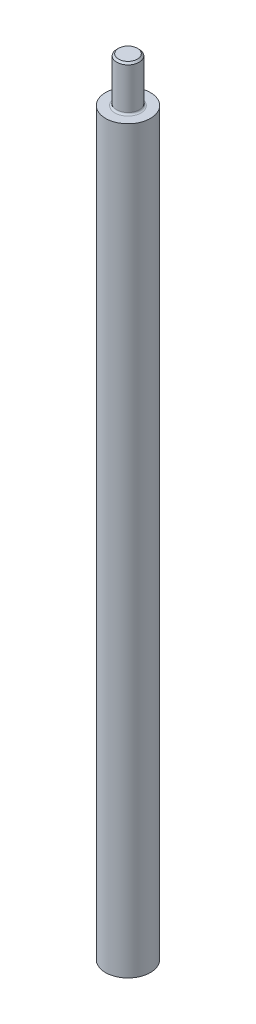
ISO-10303-21;
HEADER;
FILE_DESCRIPTION(('STEP AP214'),'2;1');
FILE_NAME('part.step','',(''),(''),'','','');
FILE_SCHEMA(('AUTOMOTIVE_DESIGN { 1 0 10303 214 1 1 1 1 }'));
ENDSEC;
DATA;
#1=APPLICATION_CONTEXT('core data for automotive mechanical design processes');
#2=APPLICATION_PROTOCOL_DEFINITION('international standard','automotive_design',2000,#1);
#3=PRODUCT_CONTEXT('',#1,'mechanical');
#4=PRODUCT('Part','Part','',(#3));
#5=PRODUCT_RELATED_PRODUCT_CATEGORY('part','',(#4));
#6=PRODUCT_DEFINITION_FORMATION('','',#4);
#7=PRODUCT_DEFINITION_CONTEXT('part definition',#1,'design');
#8=PRODUCT_DEFINITION('design','',#6,#7);
#9=PRODUCT_DEFINITION_SHAPE('','',#8);
#10=(LENGTH_UNIT() NAMED_UNIT(*) SI_UNIT(.MILLI.,.METRE.));
#11=(NAMED_UNIT(*) PLANE_ANGLE_UNIT() SI_UNIT($,.RADIAN.));
#12=(NAMED_UNIT(*) SI_UNIT($,.STERADIAN.) SOLID_ANGLE_UNIT());
#13=UNCERTAINTY_MEASURE_WITH_UNIT(LENGTH_MEASURE(1.E-05),#10,'distance_accuracy_value','');
#14=(GEOMETRIC_REPRESENTATION_CONTEXT(3) GLOBAL_UNCERTAINTY_ASSIGNED_CONTEXT((#13)) GLOBAL_UNIT_ASSIGNED_CONTEXT((#10,
#11,#12)) REPRESENTATION_CONTEXT('',''));
#15=CARTESIAN_POINT('',(0.,0.,0.));
#16=DIRECTION('',(0.,0.,1.));
#17=DIRECTION('',(1.,0.,0.));
#18=AXIS2_PLACEMENT_3D('',#15,#16,#17);
#19=CARTESIAN_POINT('',(0.,104.775,0.));
#20=DIRECTION('',(0.,-1.,0.));
#21=DIRECTION('',(0.,0.,-1.));
#22=AXIS2_PLACEMENT_3D('',#19,#20,#21);
#23=CYLINDRICAL_SURFACE('',#22,6.35);
#24=CARTESIAN_POINT('',(0.,104.775,0.));
#25=DIRECTION('',(0.,1.,0.));
#26=DIRECTION('',(0.,0.,1.));
#27=AXIS2_PLACEMENT_3D('',#24,#25,#26);
#28=CIRCLE('',#27,6.35);
#29=CARTESIAN_POINT('',(0.,104.775,6.35));
#30=VERTEX_POINT('',#29);
#31=EDGE_CURVE('E51',#30,#30,#28,.T.);
#32=ORIENTED_EDGE('',*,*,#31,.F.);
#33=EDGE_LOOP('',(#32));
#34=FACE_BOUND('',#33,.T.);
#35=CARTESIAN_POINT('',(0.,-104.775,0.));
#36=DIRECTION('',(0.,1.,0.));
#37=DIRECTION('',(0.,0.,1.));
#38=AXIS2_PLACEMENT_3D('',#35,#36,#37);
#39=CIRCLE('',#38,6.35);
#40=CARTESIAN_POINT('',(0.,-104.775,6.35));
#41=VERTEX_POINT('',#40);
#42=EDGE_CURVE('E52',#41,#41,#39,.T.);
#43=ORIENTED_EDGE('',*,*,#42,.T.);
#44=EDGE_LOOP('',(#43));
#45=FACE_BOUND('',#44,.T.);
#46=ADVANCED_FACE('F31',(#34,#45),#23,.T.);
#47=CARTESIAN_POINT('',(0.,104.775,0.));
#48=DIRECTION('',(0.,1.,0.));
#49=DIRECTION('',(0.,0.,1.));
#50=AXIS2_PLACEMENT_3D('',#47,#48,#49);
#51=PLANE('',#50);
#52=CARTESIAN_POINT('',(0.,104.775,0.));
#53=DIRECTION('',(0.,1.,0.));
#54=DIRECTION('',(0.,0.,1.));
#55=AXIS2_PLACEMENT_3D('',#52,#53,#54);
#56=CIRCLE('',#55,3.683);
#57=CARTESIAN_POINT('',(0.,104.775,3.683));
#58=VERTEX_POINT('',#57);
#59=EDGE_CURVE('E42',#58,#58,#56,.F.);
#60=ORIENTED_EDGE('',*,*,#59,.T.);
#61=EDGE_LOOP('',(#60));
#62=FACE_BOUND('',#61,.T.);
#63=ORIENTED_EDGE('',*,*,#31,.T.);
#64=EDGE_LOOP('',(#63));
#65=FACE_BOUND('',#64,.T.);
#66=ADVANCED_FACE('F58',(#62,#65),#51,.T.);
#67=CARTESIAN_POINT('',(0.,-104.775,0.));
#68=DIRECTION('',(0.,1.,0.));
#69=DIRECTION('',(0.,0.,1.));
#70=AXIS2_PLACEMENT_3D('',#67,#68,#69);
#71=PLANE('',#70);
#72=ORIENTED_EDGE('',*,*,#42,.F.);
#73=EDGE_LOOP('',(#72));
#74=FACE_BOUND('',#73,.T.);
#75=ADVANCED_FACE('F65',(#74),#71,.F.);
#76=CARTESIAN_POINT('',(0.,117.475,0.));
#77=DIRECTION('',(0.,-1.,0.));
#78=DIRECTION('',(0.,0.,-1.));
#79=AXIS2_PLACEMENT_3D('',#76,#77,#78);
#80=CYLINDRICAL_SURFACE('',#79,3.175);
#81=CARTESIAN_POINT('',(0.,116.967,0.));
#82=DIRECTION('',(0.,1.,0.));
#83=DIRECTION('',(0.,0.,1.));
#84=AXIS2_PLACEMENT_3D('',#81,#82,#83);
#85=CIRCLE('',#84,3.175);
#86=CARTESIAN_POINT('',(0.,116.967,3.175));
#87=VERTEX_POINT('',#86);
#88=EDGE_CURVE('E10',#87,#87,#85,.F.);
#89=ORIENTED_EDGE('',*,*,#88,.T.);
#90=EDGE_LOOP('',(#89));
#91=FACE_BOUND('',#90,.T.);
#92=CARTESIAN_POINT('',(0.,105.283,0.));
#93=DIRECTION('',(0.,1.,0.));
#94=DIRECTION('',(0.,0.,1.));
#95=AXIS2_PLACEMENT_3D('',#92,#93,#94);
#96=CIRCLE('',#95,3.175);
#97=CARTESIAN_POINT('',(0.,105.283,3.175));
#98=VERTEX_POINT('',#97);
#99=EDGE_CURVE('E46',#98,#98,#96,.T.);
#100=ORIENTED_EDGE('',*,*,#99,.T.);
#101=EDGE_LOOP('',(#100));
#102=FACE_BOUND('',#101,.T.);
#103=ADVANCED_FACE('F67',(#91,#102),#80,.T.);
#104=CARTESIAN_POINT('',(0.,117.475,0.));
#105=DIRECTION('',(0.,1.,0.));
#106=DIRECTION('',(0.,0.,1.));
#107=AXIS2_PLACEMENT_3D('',#104,#105,#106);
#108=PLANE('',#107);
#109=CARTESIAN_POINT('',(0.,117.475,0.));
#110=DIRECTION('',(0.,1.,0.));
#111=DIRECTION('',(0.,0.,1.));
#112=AXIS2_PLACEMENT_3D('',#109,#110,#111);
#113=CIRCLE('',#112,2.667);
#114=CARTESIAN_POINT('',(0.,117.475,2.667));
#115=VERTEX_POINT('',#114);
#116=EDGE_CURVE('E38',#115,#115,#113,.T.);
#117=ORIENTED_EDGE('',*,*,#116,.T.);
#118=EDGE_LOOP('',(#117));
#119=FACE_BOUND('',#118,.T.);
#120=ADVANCED_FACE('F74',(#119),#108,.T.);
#121=CARTESIAN_POINT('',(0.,105.283,0.));
#122=DIRECTION('',(0.,1.,0.));
#123=DIRECTION('',(0.,0.,1.));
#124=AXIS2_PLACEMENT_3D('',#121,#122,#123);
#125=TOROIDAL_SURFACE('',#124,3.683,0.508);
#126=ORIENTED_EDGE('',*,*,#59,.F.);
#127=EDGE_LOOP('',(#126));
#128=FACE_BOUND('',#127,.T.);
#129=ORIENTED_EDGE('',*,*,#99,.F.);
#130=EDGE_LOOP('',(#129));
#131=FACE_BOUND('',#130,.T.);
#132=ADVANCED_FACE('F79',(#128,#131),#125,.F.);
#133=CARTESIAN_POINT('',(0.,117.475,0.));
#134=DIRECTION('',(0.,-1.,0.));
#135=DIRECTION('',(0.,0.,-1.));
#136=AXIS2_PLACEMENT_3D('',#133,#134,#135);
#137=CONICAL_SURFACE('',#136,2.667,0.785398163397437);
#138=ORIENTED_EDGE('',*,*,#88,.F.);
#139=EDGE_LOOP('',(#138));
#140=FACE_BOUND('',#139,.T.);
#141=ORIENTED_EDGE('',*,*,#116,.F.);
#142=EDGE_LOOP('',(#141));
#143=FACE_BOUND('',#142,.T.);
#144=ADVANCED_FACE('F33',(#140,#143),#137,.T.);
#145=CLOSED_SHELL('',(#46,#66,#75,#103,#120,#132,#144));
#146=MANIFOLD_SOLID_BREP('B2',#145);
#147=ADVANCED_BREP_SHAPE_REPRESENTATION('',(#18,#146),#14);
#148=SHAPE_DEFINITION_REPRESENTATION(#9,#147);
ENDSEC;
END-ISO-10303-21;
